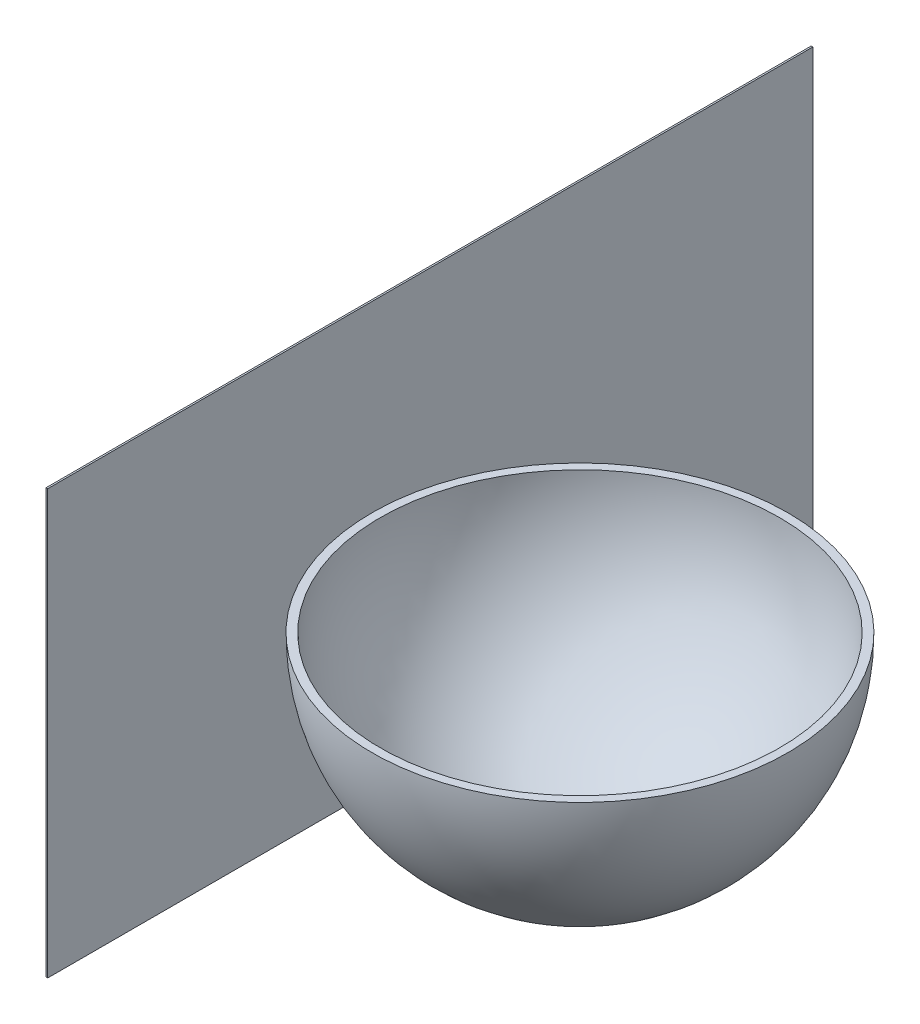
ISO-10303-21;
HEADER;
FILE_DESCRIPTION(('STEP AP214'),'2;1');
FILE_NAME('part.step','',(''),(''),'','','');
FILE_SCHEMA(('AUTOMOTIVE_DESIGN { 1 0 10303 214 1 1 1 1 }'));
ENDSEC;
DATA;
#1=APPLICATION_CONTEXT('core data for automotive mechanical design processes');
#2=APPLICATION_PROTOCOL_DEFINITION('international standard','automotive_design',2000,#1);
#3=PRODUCT_CONTEXT('',#1,'mechanical');
#4=PRODUCT('Part','Part','',(#3));
#5=PRODUCT_RELATED_PRODUCT_CATEGORY('part','',(#4));
#6=PRODUCT_DEFINITION_FORMATION('','',#4);
#7=PRODUCT_DEFINITION_CONTEXT('part definition',#1,'design');
#8=PRODUCT_DEFINITION('design','',#6,#7);
#9=PRODUCT_DEFINITION_SHAPE('','',#8);
#10=(LENGTH_UNIT() NAMED_UNIT(*) SI_UNIT(.MILLI.,.METRE.));
#11=(NAMED_UNIT(*) PLANE_ANGLE_UNIT() SI_UNIT($,.RADIAN.));
#12=(NAMED_UNIT(*) SI_UNIT($,.STERADIAN.) SOLID_ANGLE_UNIT());
#13=UNCERTAINTY_MEASURE_WITH_UNIT(LENGTH_MEASURE(1.E-05),#10,'distance_accuracy_value','');
#14=(GEOMETRIC_REPRESENTATION_CONTEXT(3) GLOBAL_UNCERTAINTY_ASSIGNED_CONTEXT((#13)) GLOBAL_UNIT_ASSIGNED_CONTEXT((#10,
#11,#12)) REPRESENTATION_CONTEXT('',''));
#15=CARTESIAN_POINT('',(0.,0.,0.));
#16=DIRECTION('',(0.,0.,1.));
#17=DIRECTION('',(1.,0.,0.));
#18=AXIS2_PLACEMENT_3D('',#15,#16,#17);
#19=CARTESIAN_POINT('',(-146.,204.78240283249,-285.));
#20=DIRECTION('',(0.,0.,-1.));
#21=DIRECTION('',(-1.,0.,0.));
#22=AXIS2_PLACEMENT_3D('',#19,#20,#21);
#23=PLANE('',#22);
#24=DIRECTION('',(0.,1.,0.));
#25=VECTOR('',#24,1.);
#26=CARTESIAN_POINT('',(-145.,204.78240283249,-285.));
#27=LINE('',#26,#25);
#28=CARTESIAN_POINT('',(-145.,-50.,-285.));
#29=VERTEX_POINT('',#28);
#30=CARTESIAN_POINT('',(-145.,204.78240283249,-285.));
#31=VERTEX_POINT('',#30);
#32=EDGE_CURVE('E111',#29,#31,#27,.T.);
#33=ORIENTED_EDGE('',*,*,#32,.F.);
#34=DIRECTION('',(1.,0.,0.));
#35=VECTOR('',#34,1.);
#36=CARTESIAN_POINT('',(-146.,-50.,-285.));
#37=LINE('',#36,#35);
#38=CARTESIAN_POINT('',(-146.,-50.,-285.));
#39=VERTEX_POINT('',#38);
#40=EDGE_CURVE('E12',#39,#29,#37,.T.);
#41=ORIENTED_EDGE('',*,*,#40,.F.);
#42=DIRECTION('',(0.,1.,0.));
#43=VECTOR('',#42,1.);
#44=CARTESIAN_POINT('',(-146.,204.78240283249,-285.));
#45=LINE('',#44,#43);
#46=CARTESIAN_POINT('',(-146.,204.78240283249,-285.));
#47=VERTEX_POINT('',#46);
#48=EDGE_CURVE('E105',#39,#47,#45,.T.);
#49=ORIENTED_EDGE('',*,*,#48,.T.);
#50=DIRECTION('',(1.,0.,0.));
#51=VECTOR('',#50,1.);
#52=CARTESIAN_POINT('',(-146.,204.78240283249,-285.));
#53=LINE('',#52,#51);
#54=EDGE_CURVE('E50',#47,#31,#53,.T.);
#55=ORIENTED_EDGE('',*,*,#54,.T.);
#56=EDGE_LOOP('',(#33,#41,#49,#55));
#57=FACE_BOUND('',#56,.T.);
#58=ADVANCED_FACE('F47',(#57),#23,.T.);
#59=CARTESIAN_POINT('',(-146.,-50.,175.));
#60=DIRECTION('',(0.,-1.,0.));
#61=DIRECTION('',(0.,0.,-1.));
#62=AXIS2_PLACEMENT_3D('',#59,#60,#61);
#63=PLANE('',#62);
#64=DIRECTION('',(0.,0.,-1.));
#65=VECTOR('',#64,1.);
#66=CARTESIAN_POINT('',(-145.,-50.,175.));
#67=LINE('',#66,#65);
#68=CARTESIAN_POINT('',(-145.,-50.,175.));
#69=VERTEX_POINT('',#68);
#70=EDGE_CURVE('E107',#69,#29,#67,.T.);
#71=ORIENTED_EDGE('',*,*,#70,.F.);
#72=DIRECTION('',(1.,0.,0.));
#73=VECTOR('',#72,1.);
#74=CARTESIAN_POINT('',(-146.,-50.,175.));
#75=LINE('',#74,#73);
#76=CARTESIAN_POINT('',(-146.,-50.,175.));
#77=VERTEX_POINT('',#76);
#78=EDGE_CURVE('E56',#77,#69,#75,.T.);
#79=ORIENTED_EDGE('',*,*,#78,.F.);
#80=DIRECTION('',(0.,0.,-1.));
#81=VECTOR('',#80,1.);
#82=CARTESIAN_POINT('',(-146.,-50.,175.));
#83=LINE('',#82,#81);
#84=EDGE_CURVE('E102',#77,#39,#83,.T.);
#85=ORIENTED_EDGE('',*,*,#84,.T.);
#86=ORIENTED_EDGE('',*,*,#40,.T.);
#87=EDGE_LOOP('',(#71,#79,#85,#86));
#88=FACE_BOUND('',#87,.T.);
#89=ADVANCED_FACE('F121',(#88),#63,.T.);
#90=CARTESIAN_POINT('',(-146.,204.78240283249,175.));
#91=DIRECTION('',(0.,0.,1.));
#92=DIRECTION('',(0.,-1.,0.));
#93=AXIS2_PLACEMENT_3D('',#90,#91,#92);
#94=PLANE('',#93);
#95=DIRECTION('',(0.,-1.,0.));
#96=VECTOR('',#95,1.);
#97=CARTESIAN_POINT('',(-145.,204.78240283249,175.));
#98=LINE('',#97,#96);
#99=CARTESIAN_POINT('',(-145.,204.78240283249,175.));
#100=VERTEX_POINT('',#99);
#101=EDGE_CURVE('E97',#100,#69,#98,.T.);
#102=ORIENTED_EDGE('',*,*,#101,.F.);
#103=DIRECTION('',(1.,0.,0.));
#104=VECTOR('',#103,1.);
#105=CARTESIAN_POINT('',(-146.,204.78240283249,175.));
#106=LINE('',#105,#104);
#107=CARTESIAN_POINT('',(-146.,204.78240283249,175.));
#108=VERTEX_POINT('',#107);
#109=EDGE_CURVE('E92',#108,#100,#106,.T.);
#110=ORIENTED_EDGE('',*,*,#109,.F.);
#111=DIRECTION('',(0.,-1.,0.));
#112=VECTOR('',#111,1.);
#113=CARTESIAN_POINT('',(-146.,204.78240283249,175.));
#114=LINE('',#113,#112);
#115=EDGE_CURVE('E95',#108,#77,#114,.T.);
#116=ORIENTED_EDGE('',*,*,#115,.T.);
#117=ORIENTED_EDGE('',*,*,#78,.T.);
#118=EDGE_LOOP('',(#102,#110,#116,#117));
#119=FACE_BOUND('',#118,.T.);
#120=ADVANCED_FACE('F94',(#119),#94,.T.);
#121=CARTESIAN_POINT('',(-146.,204.78240283249,175.));
#122=DIRECTION('',(0.,1.,0.));
#123=DIRECTION('',(0.,0.,1.));
#124=AXIS2_PLACEMENT_3D('',#121,#122,#123);
#125=PLANE('',#124);
#126=DIRECTION('',(0.,0.,1.));
#127=VECTOR('',#126,1.);
#128=CARTESIAN_POINT('',(-145.,204.78240283249,175.));
#129=LINE('',#128,#127);
#130=EDGE_CURVE('E114',#31,#100,#129,.T.);
#131=ORIENTED_EDGE('',*,*,#130,.F.);
#132=ORIENTED_EDGE('',*,*,#54,.F.);
#133=DIRECTION('',(0.,0.,1.));
#134=VECTOR('',#133,1.);
#135=CARTESIAN_POINT('',(-146.,204.78240283249,175.));
#136=LINE('',#135,#134);
#137=EDGE_CURVE('E101',#47,#108,#136,.T.);
#138=ORIENTED_EDGE('',*,*,#137,.T.);
#139=ORIENTED_EDGE('',*,*,#109,.T.);
#140=EDGE_LOOP('',(#131,#132,#138,#139));
#141=FACE_BOUND('',#140,.T.);
#142=ADVANCED_FACE('F104',(#141),#125,.T.);
#143=CARTESIAN_POINT('',(-146.,0.,0.));
#144=DIRECTION('',(1.,0.,0.));
#145=DIRECTION('',(0.,0.,-1.));
#146=AXIS2_PLACEMENT_3D('',#143,#144,#145);
#147=PLANE('',#146);
#148=ORIENTED_EDGE('',*,*,#48,.F.);
#149=ORIENTED_EDGE('',*,*,#84,.F.);
#150=ORIENTED_EDGE('',*,*,#115,.F.);
#151=ORIENTED_EDGE('',*,*,#137,.F.);
#152=EDGE_LOOP('',(#148,#149,#150,#151));
#153=FACE_BOUND('',#152,.T.);
#154=ADVANCED_FACE('F100',(#153),#147,.F.);
#155=CARTESIAN_POINT('',(-145.,0.,0.));
#156=DIRECTION('',(1.,0.,0.));
#157=DIRECTION('',(0.,0.,-1.));
#158=AXIS2_PLACEMENT_3D('',#155,#156,#157);
#159=PLANE('',#158);
#160=ORIENTED_EDGE('',*,*,#32,.T.);
#161=ORIENTED_EDGE('',*,*,#130,.T.);
#162=ORIENTED_EDGE('',*,*,#101,.T.);
#163=ORIENTED_EDGE('',*,*,#70,.T.);
#164=EDGE_LOOP('',(#160,#161,#162,#163));
#165=FACE_BOUND('',#164,.T.);
#166=ADVANCED_FACE('F120',(#165),#159,.T.);
#167=CLOSED_SHELL('',(#58,#89,#120,#142,#154,#166));
#168=MANIFOLD_SOLID_BREP('B2',#167);
#169=CARTESIAN_POINT('',(0.,114.78240283249,0.));
#170=DIRECTION('',(0.,1.,0.));
#171=DIRECTION('',(0.,0.,1.));
#172=AXIS2_PLACEMENT_3D('',#169,#170,#171);
#173=PLANE('',#172);
#174=CARTESIAN_POINT('',(0.,114.78240283249,0.));
#175=DIRECTION('',(0.,-1.,0.));
#176=DIRECTION('',(0.,0.,-1.));
#177=AXIS2_PLACEMENT_3D('',#174,#175,#176);
#178=CIRCLE('',#177,125.);
#179=CARTESIAN_POINT('',(0.,114.78240283249,-125.));
#180=VERTEX_POINT('',#179);
#181=EDGE_CURVE('E46',#180,#180,#178,.T.);
#182=ORIENTED_EDGE('',*,*,#181,.F.);
#183=EDGE_LOOP('',(#182));
#184=FACE_BOUND('',#183,.T.);
#185=CARTESIAN_POINT('',(0.,114.78240283249,0.));
#186=DIRECTION('',(0.,-1.,0.));
#187=DIRECTION('',(0.,0.,-1.));
#188=AXIS2_PLACEMENT_3D('',#185,#186,#187);
#189=CIRCLE('',#188,120.);
#190=CARTESIAN_POINT('',(0.,114.78240283249,-120.));
#191=VERTEX_POINT('',#190);
#192=EDGE_CURVE('E195',#191,#191,#189,.T.);
#193=ORIENTED_EDGE('',*,*,#192,.T.);
#194=EDGE_LOOP('',(#193));
#195=FACE_BOUND('',#194,.T.);
#196=ADVANCED_FACE('F183',(#184,#195),#173,.T.);
#197=CARTESIAN_POINT('',(35.,-5.,0.));
#198=DIRECTION('',(0.,-1.,0.));
#199=DIRECTION('',(0.,0.,-1.));
#200=AXIS2_PLACEMENT_3D('',#197,#198,#199);
#201=PLANE('',#200);
#202=CARTESIAN_POINT('',(0.,-5.,0.));
#203=DIRECTION('',(0.,-1.,0.));
#204=DIRECTION('',(0.,0.,-1.));
#205=AXIS2_PLACEMENT_3D('',#202,#203,#204);
#206=CIRCLE('',#205,35.7375988515611);
#207=CARTESIAN_POINT('',(0.,-5.,-35.7375988515611));
#208=VERTEX_POINT('',#207);
#209=EDGE_CURVE('E190',#208,#208,#206,.T.);
#210=ORIENTED_EDGE('',*,*,#209,.T.);
#211=EDGE_LOOP('',(#210));
#212=FACE_BOUND('',#211,.T.);
#213=ADVANCED_FACE('F214',(#212),#201,.T.);
#214=CARTESIAN_POINT('',(0.,114.78240283249,0.));
#215=DIRECTION('',(0.,-1.,0.));
#216=DIRECTION('',(1.,0.,0.));
#217=AXIS2_PLACEMENT_3D('',#214,#215,#216);
#218=SPHERICAL_SURFACE('',#217,125.);
#219=ORIENTED_EDGE('',*,*,#181,.T.);
#220=EDGE_LOOP('',(#219));
#221=FACE_BOUND('',#220,.T.);
#222=ORIENTED_EDGE('',*,*,#209,.F.);
#223=EDGE_LOOP('',(#222));
#224=FACE_BOUND('',#223,.T.);
#225=ADVANCED_FACE('F207',(#221,#224),#218,.T.);
#226=CARTESIAN_POINT('',(35.,0.,0.));
#227=DIRECTION('',(0.,-1.,0.));
#228=DIRECTION('',(0.,0.,-1.));
#229=AXIS2_PLACEMENT_3D('',#226,#227,#228);
#230=PLANE('',#229);
#231=CARTESIAN_POINT('',(0.,0.,0.));
#232=DIRECTION('',(0.,-1.,0.));
#233=DIRECTION('',(0.,0.,-1.));
#234=AXIS2_PLACEMENT_3D('',#231,#232,#233);
#235=CIRCLE('',#234,35.);
#236=CARTESIAN_POINT('',(0.,0.,-35.));
#237=VERTEX_POINT('',#236);
#238=EDGE_CURVE('E186',#237,#237,#235,.T.);
#239=ORIENTED_EDGE('',*,*,#238,.F.);
#240=EDGE_LOOP('',(#239));
#241=FACE_BOUND('',#240,.T.);
#242=ADVANCED_FACE('F205',(#241),#230,.F.);
#243=CARTESIAN_POINT('',(0.,114.78240283249,0.));
#244=DIRECTION('',(0.,-1.,0.));
#245=DIRECTION('',(1.,0.,0.));
#246=AXIS2_PLACEMENT_3D('',#243,#244,#245);
#247=SPHERICAL_SURFACE('',#246,120.);
#248=ORIENTED_EDGE('',*,*,#192,.F.);
#249=EDGE_LOOP('',(#248));
#250=FACE_BOUND('',#249,.T.);
#251=ORIENTED_EDGE('',*,*,#238,.T.);
#252=EDGE_LOOP('',(#251));
#253=FACE_BOUND('',#252,.T.);
#254=ADVANCED_FACE('F203',(#250,#253),#247,.F.);
#255=CLOSED_SHELL('',(#196,#213,#225,#242,#254));
#256=MANIFOLD_SOLID_BREP('B6',#255);
#257=ADVANCED_BREP_SHAPE_REPRESENTATION('',(#18,#168,#256),#14);
#258=SHAPE_DEFINITION_REPRESENTATION(#9,#257);
ENDSEC;
END-ISO-10303-21;
